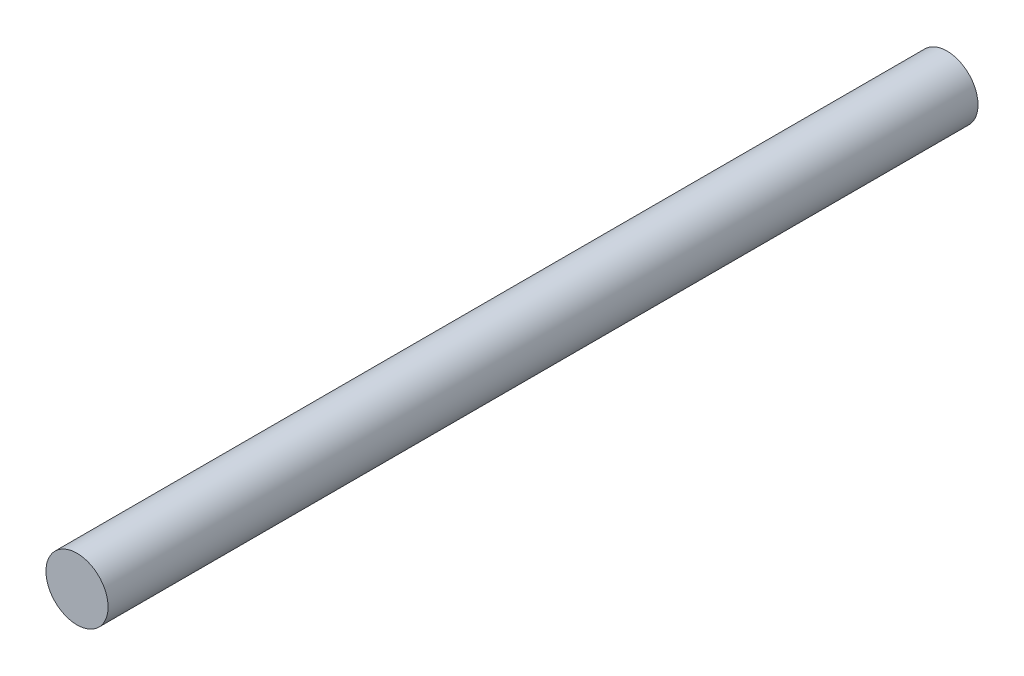
ISO-10303-21;
HEADER;
FILE_DESCRIPTION(('STEP AP214'),'2;1');
FILE_NAME('part.step','',(''),(''),'','','');
FILE_SCHEMA(('AUTOMOTIVE_DESIGN { 1 0 10303 214 1 1 1 1 }'));
ENDSEC;
DATA;
#1=APPLICATION_CONTEXT('core data for automotive mechanical design processes');
#2=APPLICATION_PROTOCOL_DEFINITION('international standard','automotive_design',2000,#1);
#3=PRODUCT_CONTEXT('',#1,'mechanical');
#4=PRODUCT('Part','Part','',(#3));
#5=PRODUCT_RELATED_PRODUCT_CATEGORY('part','',(#4));
#6=PRODUCT_DEFINITION_FORMATION('','',#4);
#7=PRODUCT_DEFINITION_CONTEXT('part definition',#1,'design');
#8=PRODUCT_DEFINITION('design','',#6,#7);
#9=PRODUCT_DEFINITION_SHAPE('','',#8);
#10=(LENGTH_UNIT() NAMED_UNIT(*) SI_UNIT(.MILLI.,.METRE.));
#11=(NAMED_UNIT(*) PLANE_ANGLE_UNIT() SI_UNIT($,.RADIAN.));
#12=(NAMED_UNIT(*) SI_UNIT($,.STERADIAN.) SOLID_ANGLE_UNIT());
#13=UNCERTAINTY_MEASURE_WITH_UNIT(LENGTH_MEASURE(1.E-05),#10,'distance_accuracy_value','');
#14=(GEOMETRIC_REPRESENTATION_CONTEXT(3) GLOBAL_UNCERTAINTY_ASSIGNED_CONTEXT((#13)) GLOBAL_UNIT_ASSIGNED_CONTEXT((#10,
#11,#12)) REPRESENTATION_CONTEXT('',''));
#15=CARTESIAN_POINT('',(0.,0.,0.));
#16=DIRECTION('',(0.,0.,1.));
#17=DIRECTION('',(1.,0.,0.));
#18=AXIS2_PLACEMENT_3D('',#15,#16,#17);
#19=CARTESIAN_POINT('',(0.,0.,88.9));
#20=DIRECTION('',(0.,0.,-1.));
#21=DIRECTION('',(-1.,0.,0.));
#22=AXIS2_PLACEMENT_3D('',#19,#20,#21);
#23=CYLINDRICAL_SURFACE('',#22,6.35);
#24=CARTESIAN_POINT('',(0.,0.,88.9));
#25=DIRECTION('',(0.,0.,1.));
#26=DIRECTION('',(1.,0.,0.));
#27=AXIS2_PLACEMENT_3D('',#24,#25,#26);
#28=CIRCLE('',#27,6.35);
#29=CARTESIAN_POINT('',(6.35000000000001,0.,88.9));
#30=VERTEX_POINT('',#29);
#31=EDGE_CURVE('E10',#30,#30,#28,.T.);
#32=ORIENTED_EDGE('',*,*,#31,.F.);
#33=EDGE_LOOP('',(#32));
#34=FACE_BOUND('',#33,.T.);
#35=CARTESIAN_POINT('',(0.,0.,-88.9));
#36=DIRECTION('',(0.,0.,1.));
#37=DIRECTION('',(1.,0.,0.));
#38=AXIS2_PLACEMENT_3D('',#35,#36,#37);
#39=CIRCLE('',#38,6.35);
#40=CARTESIAN_POINT('',(6.35000000000001,0.,-88.9));
#41=VERTEX_POINT('',#40);
#42=EDGE_CURVE('E28',#41,#41,#39,.T.);
#43=ORIENTED_EDGE('',*,*,#42,.T.);
#44=EDGE_LOOP('',(#43));
#45=FACE_BOUND('',#44,.T.);
#46=ADVANCED_FACE('F22',(#34,#45),#23,.T.);
#47=CARTESIAN_POINT('',(0.,0.,88.9));
#48=DIRECTION('',(0.,0.,1.));
#49=DIRECTION('',(1.,0.,0.));
#50=AXIS2_PLACEMENT_3D('',#47,#48,#49);
#51=PLANE('',#50);
#52=ORIENTED_EDGE('',*,*,#31,.T.);
#53=EDGE_LOOP('',(#52));
#54=FACE_BOUND('',#53,.T.);
#55=ADVANCED_FACE('F37',(#54),#51,.T.);
#56=CARTESIAN_POINT('',(0.,0.,-88.9));
#57=DIRECTION('',(0.,0.,1.));
#58=DIRECTION('',(1.,0.,0.));
#59=AXIS2_PLACEMENT_3D('',#56,#57,#58);
#60=PLANE('',#59);
#61=ORIENTED_EDGE('',*,*,#42,.F.);
#62=EDGE_LOOP('',(#61));
#63=FACE_BOUND('',#62,.T.);
#64=ADVANCED_FACE('F35',(#63),#60,.F.);
#65=CLOSED_SHELL('',(#46,#55,#64));
#66=MANIFOLD_SOLID_BREP('B2',#65);
#67=ADVANCED_BREP_SHAPE_REPRESENTATION('',(#18,#66),#14);
#68=SHAPE_DEFINITION_REPRESENTATION(#9,#67);
ENDSEC;
END-ISO-10303-21;
